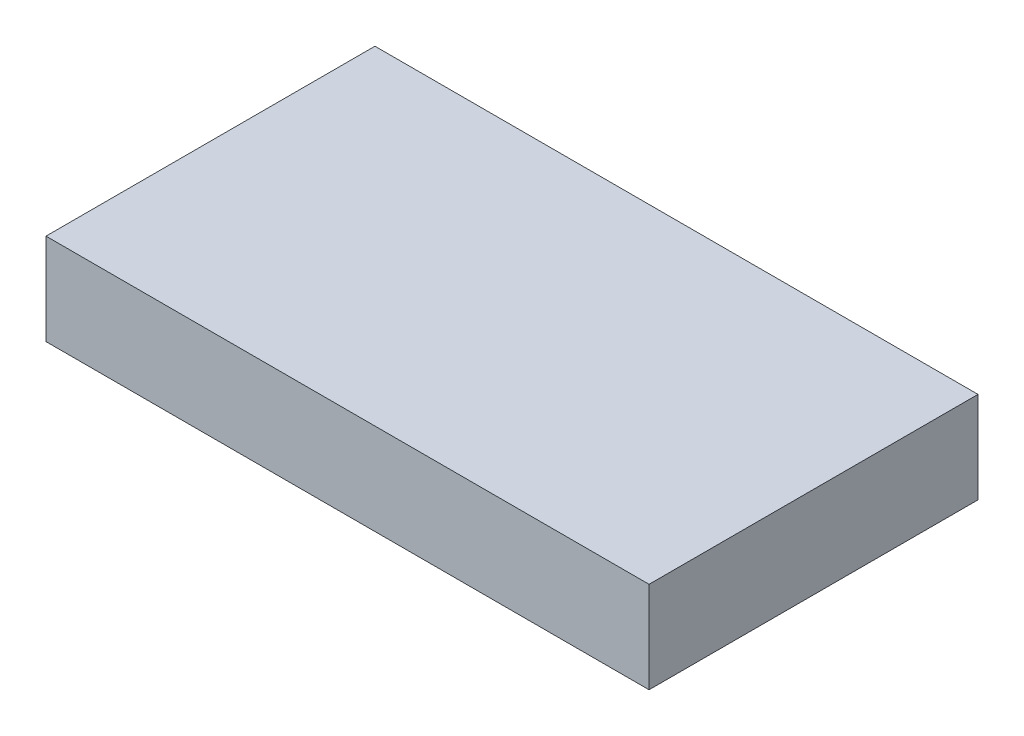
ISO-10303-21;
HEADER;
FILE_DESCRIPTION(('STEP AP214'),'2;1');
FILE_NAME('part.step','',(''),(''),'','','');
FILE_SCHEMA(('AUTOMOTIVE_DESIGN { 1 0 10303 214 1 1 1 1 }'));
ENDSEC;
DATA;
#1=APPLICATION_CONTEXT('core data for automotive mechanical design processes');
#2=APPLICATION_PROTOCOL_DEFINITION('international standard','automotive_design',2000,#1);
#3=PRODUCT_CONTEXT('',#1,'mechanical');
#4=PRODUCT('Part','Part','',(#3));
#5=PRODUCT_RELATED_PRODUCT_CATEGORY('part','',(#4));
#6=PRODUCT_DEFINITION_FORMATION('','',#4);
#7=PRODUCT_DEFINITION_CONTEXT('part definition',#1,'design');
#8=PRODUCT_DEFINITION('design','',#6,#7);
#9=PRODUCT_DEFINITION_SHAPE('','',#8);
#10=(LENGTH_UNIT() NAMED_UNIT(*) SI_UNIT(.MILLI.,.METRE.));
#11=(NAMED_UNIT(*) PLANE_ANGLE_UNIT() SI_UNIT($,.RADIAN.));
#12=(NAMED_UNIT(*) SI_UNIT($,.STERADIAN.) SOLID_ANGLE_UNIT());
#13=UNCERTAINTY_MEASURE_WITH_UNIT(LENGTH_MEASURE(1.E-05),#10,'distance_accuracy_value','');
#14=(GEOMETRIC_REPRESENTATION_CONTEXT(3) GLOBAL_UNCERTAINTY_ASSIGNED_CONTEXT((#13)) GLOBAL_UNIT_ASSIGNED_CONTEXT((#10,
#11,#12)) REPRESENTATION_CONTEXT('',''));
#15=CARTESIAN_POINT('',(0.,0.,0.));
#16=DIRECTION('',(0.,0.,1.));
#17=DIRECTION('',(1.,0.,0.));
#18=AXIS2_PLACEMENT_3D('',#15,#16,#17);
#19=CARTESIAN_POINT('',(0.,10.,0.));
#20=DIRECTION('',(1.,0.,0.));
#21=DIRECTION('',(0.,0.,-1.));
#22=AXIS2_PLACEMENT_3D('',#19,#20,#21);
#23=PLANE('',#22);
#24=DIRECTION('',(0.,0.,1.));
#25=VECTOR('',#24,1.);
#26=CARTESIAN_POINT('',(0.,0.,0.));
#27=LINE('',#26,#25);
#28=CARTESIAN_POINT('',(0.,0.,-36.));
#29=VERTEX_POINT('',#28);
#30=CARTESIAN_POINT('',(0.,0.,0.));
#31=VERTEX_POINT('',#30);
#32=EDGE_CURVE('E113',#29,#31,#27,.T.);
#33=ORIENTED_EDGE('',*,*,#32,.T.);
#34=DIRECTION('',(0.,-1.,0.));
#35=VECTOR('',#34,1.);
#36=CARTESIAN_POINT('',(0.,10.,0.));
#37=LINE('',#36,#35);
#38=CARTESIAN_POINT('',(0.,10.,0.));
#39=VERTEX_POINT('',#38);
#40=EDGE_CURVE('E11',#39,#31,#37,.T.);
#41=ORIENTED_EDGE('',*,*,#40,.F.);
#42=DIRECTION('',(0.,0.,1.));
#43=VECTOR('',#42,1.);
#44=CARTESIAN_POINT('',(0.,10.,0.));
#45=LINE('',#44,#43);
#46=CARTESIAN_POINT('',(0.,10.,-36.));
#47=VERTEX_POINT('',#46);
#48=EDGE_CURVE('E97',#47,#39,#45,.T.);
#49=ORIENTED_EDGE('',*,*,#48,.F.);
#50=DIRECTION('',(0.,-1.,0.));
#51=VECTOR('',#50,1.);
#52=CARTESIAN_POINT('',(0.,10.,-36.));
#53=LINE('',#52,#51);
#54=EDGE_CURVE('E109',#47,#29,#53,.T.);
#55=ORIENTED_EDGE('',*,*,#54,.T.);
#56=EDGE_LOOP('',(#33,#41,#49,#55));
#57=FACE_BOUND('',#56,.T.);
#58=ADVANCED_FACE('F45',(#57),#23,.F.);
#59=CARTESIAN_POINT('',(0.,10.,0.));
#60=DIRECTION('',(0.,0.,-1.));
#61=DIRECTION('',(-1.,0.,0.));
#62=AXIS2_PLACEMENT_3D('',#59,#60,#61);
#63=PLANE('',#62);
#64=DIRECTION('',(1.,0.,0.));
#65=VECTOR('',#64,1.);
#66=CARTESIAN_POINT('',(0.,0.,0.));
#67=LINE('',#66,#65);
#68=CARTESIAN_POINT('',(66.,0.,0.));
#69=VERTEX_POINT('',#68);
#70=EDGE_CURVE('E102',#31,#69,#67,.T.);
#71=ORIENTED_EDGE('',*,*,#70,.T.);
#72=DIRECTION('',(0.,-1.,0.));
#73=VECTOR('',#72,1.);
#74=CARTESIAN_POINT('',(66.,10.,0.));
#75=LINE('',#74,#73);
#76=CARTESIAN_POINT('',(66.,10.,0.));
#77=VERTEX_POINT('',#76);
#78=EDGE_CURVE('E54',#77,#69,#75,.T.);
#79=ORIENTED_EDGE('',*,*,#78,.F.);
#80=DIRECTION('',(1.,0.,0.));
#81=VECTOR('',#80,1.);
#82=CARTESIAN_POINT('',(0.,10.,0.));
#83=LINE('',#82,#81);
#84=EDGE_CURVE('E92',#39,#77,#83,.T.);
#85=ORIENTED_EDGE('',*,*,#84,.F.);
#86=ORIENTED_EDGE('',*,*,#40,.T.);
#87=EDGE_LOOP('',(#71,#79,#85,#86));
#88=FACE_BOUND('',#87,.T.);
#89=ADVANCED_FACE('F101',(#88),#63,.F.);
#90=CARTESIAN_POINT('',(66.,10.,0.));
#91=DIRECTION('',(-1.,0.,0.));
#92=DIRECTION('',(0.,0.,1.));
#93=AXIS2_PLACEMENT_3D('',#90,#91,#92);
#94=PLANE('',#93);
#95=DIRECTION('',(0.,0.,-1.));
#96=VECTOR('',#95,1.);
#97=CARTESIAN_POINT('',(66.,0.,0.));
#98=LINE('',#97,#96);
#99=CARTESIAN_POINT('',(66.,0.,-36.));
#100=VERTEX_POINT('',#99);
#101=EDGE_CURVE('E79',#69,#100,#98,.T.);
#102=ORIENTED_EDGE('',*,*,#101,.T.);
#103=DIRECTION('',(0.,-1.,0.));
#104=VECTOR('',#103,1.);
#105=CARTESIAN_POINT('',(66.,10.,-36.));
#106=LINE('',#105,#104);
#107=CARTESIAN_POINT('',(66.,10.,-36.));
#108=VERTEX_POINT('',#107);
#109=EDGE_CURVE('E104',#108,#100,#106,.T.);
#110=ORIENTED_EDGE('',*,*,#109,.F.);
#111=DIRECTION('',(0.,0.,-1.));
#112=VECTOR('',#111,1.);
#113=CARTESIAN_POINT('',(66.,10.,0.));
#114=LINE('',#113,#112);
#115=EDGE_CURVE('E95',#77,#108,#114,.T.);
#116=ORIENTED_EDGE('',*,*,#115,.F.);
#117=ORIENTED_EDGE('',*,*,#78,.T.);
#118=EDGE_LOOP('',(#102,#110,#116,#117));
#119=FACE_BOUND('',#118,.T.);
#120=ADVANCED_FACE('F105',(#119),#94,.F.);
#121=CARTESIAN_POINT('',(0.,10.,-36.));
#122=DIRECTION('',(0.,0.,1.));
#123=DIRECTION('',(1.,0.,0.));
#124=AXIS2_PLACEMENT_3D('',#121,#122,#123);
#125=PLANE('',#124);
#126=DIRECTION('',(-1.,0.,0.));
#127=VECTOR('',#126,1.);
#128=CARTESIAN_POINT('',(0.,0.,-36.));
#129=LINE('',#128,#127);
#130=EDGE_CURVE('E85',#100,#29,#129,.T.);
#131=ORIENTED_EDGE('',*,*,#130,.T.);
#132=ORIENTED_EDGE('',*,*,#54,.F.);
#133=DIRECTION('',(-1.,0.,0.));
#134=VECTOR('',#133,1.);
#135=CARTESIAN_POINT('',(0.,10.,-36.));
#136=LINE('',#135,#134);
#137=EDGE_CURVE('E62',#108,#47,#136,.T.);
#138=ORIENTED_EDGE('',*,*,#137,.F.);
#139=ORIENTED_EDGE('',*,*,#109,.T.);
#140=EDGE_LOOP('',(#131,#132,#138,#139));
#141=FACE_BOUND('',#140,.T.);
#142=ADVANCED_FACE('F126',(#141),#125,.F.);
#143=CARTESIAN_POINT('',(0.,10.,0.));
#144=DIRECTION('',(0.,-1.,0.));
#145=DIRECTION('',(0.,0.,-1.));
#146=AXIS2_PLACEMENT_3D('',#143,#144,#145);
#147=PLANE('',#146);
#148=ORIENTED_EDGE('',*,*,#48,.T.);
#149=ORIENTED_EDGE('',*,*,#84,.T.);
#150=ORIENTED_EDGE('',*,*,#115,.T.);
#151=ORIENTED_EDGE('',*,*,#137,.T.);
#152=EDGE_LOOP('',(#148,#149,#150,#151));
#153=FACE_BOUND('',#152,.T.);
#154=ADVANCED_FACE('F93',(#153),#147,.F.);
#155=CARTESIAN_POINT('',(0.,0.,0.));
#156=DIRECTION('',(0.,-1.,0.));
#157=DIRECTION('',(0.,0.,-1.));
#158=AXIS2_PLACEMENT_3D('',#155,#156,#157);
#159=PLANE('',#158);
#160=ORIENTED_EDGE('',*,*,#32,.F.);
#161=ORIENTED_EDGE('',*,*,#130,.F.);
#162=ORIENTED_EDGE('',*,*,#101,.F.);
#163=ORIENTED_EDGE('',*,*,#70,.F.);
#164=EDGE_LOOP('',(#160,#161,#162,#163));
#165=FACE_BOUND('',#164,.T.);
#166=ADVANCED_FACE('F129',(#165),#159,.T.);
#167=CLOSED_SHELL('',(#58,#89,#120,#142,#154,#166));
#168=MANIFOLD_SOLID_BREP('B2',#167);
#169=ADVANCED_BREP_SHAPE_REPRESENTATION('',(#18,#168),#14);
#170=SHAPE_DEFINITION_REPRESENTATION(#9,#169);
ENDSEC;
END-ISO-10303-21;
